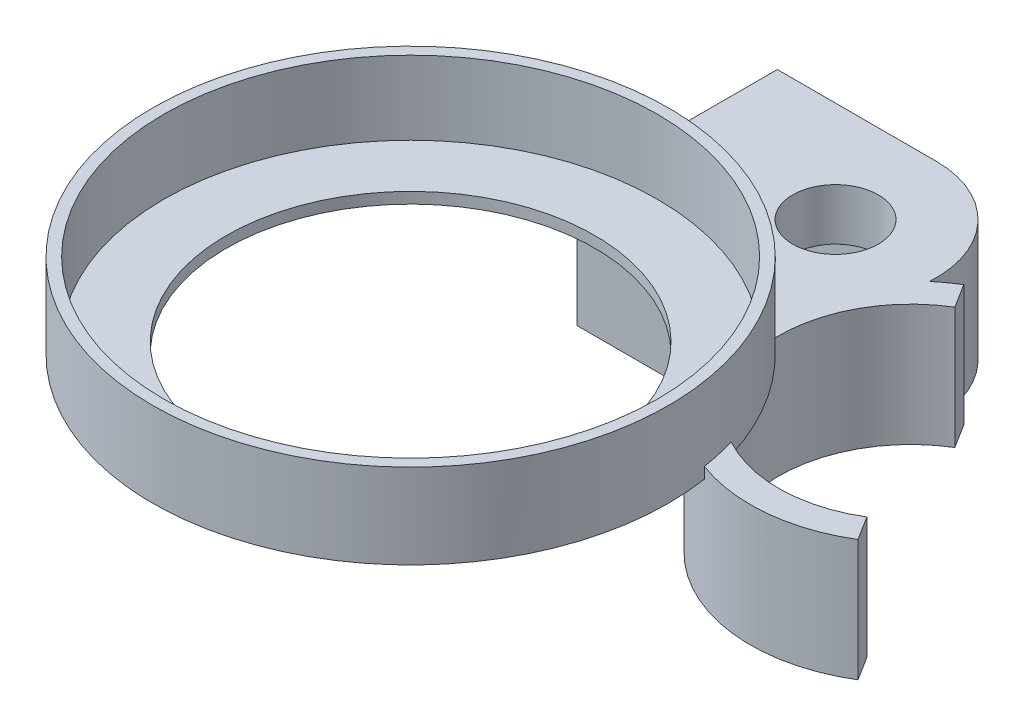
ISO-10303-21;
HEADER;
FILE_DESCRIPTION(('STEP AP214'),'2;1');
FILE_NAME('part.step','',(''),(''),'','','');
FILE_SCHEMA(('AUTOMOTIVE_DESIGN { 1 0 10303 214 1 1 1 1 }'));
ENDSEC;
DATA;
#1=APPLICATION_CONTEXT('core data for automotive mechanical design processes');
#2=APPLICATION_PROTOCOL_DEFINITION('international standard','automotive_design',2000,#1);
#3=PRODUCT_CONTEXT('',#1,'mechanical');
#4=PRODUCT('Part','Part','',(#3));
#5=PRODUCT_RELATED_PRODUCT_CATEGORY('part','',(#4));
#6=PRODUCT_DEFINITION_FORMATION('','',#4);
#7=PRODUCT_DEFINITION_CONTEXT('part definition',#1,'design');
#8=PRODUCT_DEFINITION('design','',#6,#7);
#9=PRODUCT_DEFINITION_SHAPE('','',#8);
#10=(LENGTH_UNIT() NAMED_UNIT(*) SI_UNIT(.MILLI.,.METRE.));
#11=(NAMED_UNIT(*) PLANE_ANGLE_UNIT() SI_UNIT($,.RADIAN.));
#12=(NAMED_UNIT(*) SI_UNIT($,.STERADIAN.) SOLID_ANGLE_UNIT());
#13=UNCERTAINTY_MEASURE_WITH_UNIT(LENGTH_MEASURE(1.E-05),#10,'distance_accuracy_value','');
#14=(GEOMETRIC_REPRESENTATION_CONTEXT(3) GLOBAL_UNCERTAINTY_ASSIGNED_CONTEXT((#13)) GLOBAL_UNIT_ASSIGNED_CONTEXT((#10,
#11,#12)) REPRESENTATION_CONTEXT('',''));
#15=CARTESIAN_POINT('',(0.,0.,0.));
#16=DIRECTION('',(0.,0.,1.));
#17=DIRECTION('',(1.,0.,0.));
#18=AXIS2_PLACEMENT_3D('',#15,#16,#17);
#19=CARTESIAN_POINT('',(28.9409891897683,3.,-86.4099452660348));
#20=DIRECTION('',(0.,-1.,0.));
#21=DIRECTION('',(0.,0.,-1.));
#22=AXIS2_PLACEMENT_3D('',#19,#20,#21);
#23=CYLINDRICAL_SURFACE('',#22,11.6150837606993);
#24=CARTESIAN_POINT('',(28.9409891897683,3.,-86.4099452660348));
#25=DIRECTION('',(0.,1.,0.));
#26=DIRECTION('',(0.,0.,1.));
#27=AXIS2_PLACEMENT_3D('',#24,#25,#26);
#28=CIRCLE('',#27,11.6150837606993);
#29=CARTESIAN_POINT('',(28.9409891897683,3.,-74.7948615053355));
#30=VERTEX_POINT('',#29);
#31=EDGE_CURVE('E272',#30,#30,#28,.T.);
#32=ORIENTED_EDGE('',*,*,#31,.T.);
#33=EDGE_LOOP('',(#32));
#34=FACE_BOUND('',#33,.T.);
#35=CARTESIAN_POINT('',(28.9409891897683,-11.,-86.4099452660348));
#36=DIRECTION('',(0.,-1.,0.));
#37=DIRECTION('',(0.,0.,-1.));
#38=AXIS2_PLACEMENT_3D('',#35,#36,#37);
#39=CIRCLE('',#38,11.6150837606993);
#40=CARTESIAN_POINT('',(28.9409891897683,-11.,-98.0250290267341));
#41=VERTEX_POINT('',#40);
#42=EDGE_CURVE('E43',#41,#41,#39,.T.);
#43=ORIENTED_EDGE('',*,*,#42,.T.);
#44=EDGE_LOOP('',(#43));
#45=FACE_BOUND('',#44,.T.);
#46=ADVANCED_FACE('F39',(#34,#45),#23,.F.);
#47=CARTESIAN_POINT('',(84.4408765950904,0.,-51.3693294214114));
#48=DIRECTION('',(0.,-1.,0.));
#49=DIRECTION('',(0.,0.,-1.));
#50=AXIS2_PLACEMENT_3D('',#47,#48,#49);
#51=PLANE('',#50);
#52=CARTESIAN_POINT('',(84.4408765950904,0.,-51.3693294214114));
#53=DIRECTION('',(0.,1.,0.));
#54=DIRECTION('',(0.,0.,-1.));
#55=AXIS2_PLACEMENT_3D('',#52,#53,#54);
#56=CIRCLE('',#55,35.8910066065132);
#57=CARTESIAN_POINT('',(48.5625583727208,0.,-50.4150565237816));
#58=VERTEX_POINT('',#57);
#59=CARTESIAN_POINT('',(67.0979306352017,0.,-19.9466213799145));
#60=VERTEX_POINT('',#59);
#61=EDGE_CURVE('E11',#58,#60,#56,.T.);
#62=ORIENTED_EDGE('',*,*,#61,.F.);
#63=CARTESIAN_POINT('',(0.,0.,0.));
#64=DIRECTION('',(0.,1.,0.));
#65=DIRECTION('',(0.,0.,1.));
#66=AXIS2_PLACEMENT_3D('',#63,#64,#65);
#67=CIRCLE('',#66,70.);
#68=EDGE_CURVE('E284',#60,#58,#67,.T.);
#69=ORIENTED_EDGE('',*,*,#68,.F.);
#70=EDGE_LOOP('',(#62,#69));
#71=FACE_BOUND('',#70,.T.);
#72=ADVANCED_FACE('F399',(#71),#51,.T.);
#73=CARTESIAN_POINT('',(84.4408765950904,3.,-51.3693294214114));
#74=DIRECTION('',(0.,-1.,0.));
#75=DIRECTION('',(0.,0.,-1.));
#76=AXIS2_PLACEMENT_3D('',#73,#74,#75);
#77=PLANE('',#76);
#78=CARTESIAN_POINT('',(0.,3.,0.));
#79=DIRECTION('',(0.,1.,0.));
#80=DIRECTION('',(0.,0.,1.));
#81=AXIS2_PLACEMENT_3D('',#78,#79,#80);
#82=CIRCLE('',#81,70.);
#83=CARTESIAN_POINT('',(69.1988699787437,3.,-10.5601322749733));
#84=VERTEX_POINT('',#83);
#85=CARTESIAN_POINT('',(67.0979306352017,3.,-19.9466213799145));
#86=VERTEX_POINT('',#85);
#87=EDGE_CURVE('E264',#84,#86,#82,.T.);
#88=ORIENTED_EDGE('',*,*,#87,.F.);
#89=CARTESIAN_POINT('',(84.4408765950904,3.,-51.3693294214114));
#90=DIRECTION('',(0.,1.,0.));
#91=DIRECTION('',(0.,0.,-1.));
#92=AXIS2_PLACEMENT_3D('',#89,#90,#91);
#93=CIRCLE('',#92,43.5627058093228);
#94=CARTESIAN_POINT('',(107.211450058935,3.,-14.2316084149029));
#95=VERTEX_POINT('',#94);
#96=EDGE_CURVE('E288',#84,#95,#93,.T.);
#97=ORIENTED_EDGE('',*,*,#96,.T.);
#98=DIRECTION('',(-0.530315092657825,0.,-0.847800626621214));
#99=VECTOR('',#98,1.);
#100=CARTESIAN_POINT('',(103.142834496151,3.,-20.7359958467623));
#101=LINE('',#100,#99);
#102=CARTESIAN_POINT('',(103.142834496151,3.,-20.7359958467623));
#103=VERTEX_POINT('',#102);
#104=EDGE_CURVE('E292',#95,#103,#101,.T.);
#105=ORIENTED_EDGE('',*,*,#104,.T.);
#106=CARTESIAN_POINT('',(84.4408765950904,3.,-51.3693294214114));
#107=DIRECTION('',(0.,-1.,0.));
#108=DIRECTION('',(0.,0.,-1.));
#109=AXIS2_PLACEMENT_3D('',#106,#107,#108);
#110=CIRCLE('',#109,35.8910066065132);
#111=EDGE_CURVE('E296',#103,#86,#110,.T.);
#112=ORIENTED_EDGE('',*,*,#111,.T.);
#113=EDGE_LOOP('',(#88,#97,#105,#112));
#114=FACE_BOUND('',#113,.T.);
#115=ADVANCED_FACE('F391',(#114),#77,.F.);
#116=CARTESIAN_POINT('',(0.,3.,0.));
#117=DIRECTION('',(0.,1.,0.));
#118=DIRECTION('',(0.,0.,1.));
#119=AXIS2_PLACEMENT_3D('',#116,#117,#118);
#120=CIRCLE('',#119,50.);
#121=CARTESIAN_POINT('',(0.,3.,50.));
#122=VERTEX_POINT('',#121);
#123=EDGE_CURVE('E280',#122,#122,#120,.T.);
#124=ORIENTED_EDGE('',*,*,#123,.F.);
#125=EDGE_LOOP('',(#124));
#126=FACE_BOUND('',#125,.T.);
#127=CARTESIAN_POINT('',(0.,3.,0.));
#128=DIRECTION('',(0.,1.,0.));
#129=DIRECTION('',(0.,0.,1.));
#130=AXIS2_PLACEMENT_3D('',#127,#128,#129);
#131=CIRCLE('',#130,67.);
#132=CARTESIAN_POINT('',(0.,3.,67.));
#133=VERTEX_POINT('',#132);
#134=EDGE_CURVE('E259',#133,#133,#131,.T.);
#135=ORIENTED_EDGE('',*,*,#134,.T.);
#136=EDGE_LOOP('',(#135));
#137=FACE_BOUND('',#136,.T.);
#138=ADVANCED_FACE('F406',(#126,#137),#77,.F.);
#139=CARTESIAN_POINT('',(48.5625583727208,3.,-50.4150565237816));
#140=VERTEX_POINT('',#139);
#141=CARTESIAN_POINT('',(-14.2233794623213,3.,-68.5397364794381));
#142=VERTEX_POINT('',#141);
#143=EDGE_CURVE('E246',#140,#142,#82,.T.);
#144=ORIENTED_EDGE('',*,*,#143,.F.);
#145=CARTESIAN_POINT('',(84.4408765950904,3.,-51.3693294214114));
#146=DIRECTION('',(0.,-1.,0.));
#147=DIRECTION('',(0.,0.,-1.));
#148=AXIS2_PLACEMENT_3D('',#145,#146,#147);
#149=CIRCLE('',#148,35.8910066065132);
#150=CARTESIAN_POINT('',(65.7389186940296,3.,-82.0026629960604));
#151=VERTEX_POINT('',#150);
#152=EDGE_CURVE('E299',#140,#151,#149,.T.);
#153=ORIENTED_EDGE('',*,*,#152,.T.);
#154=DIRECTION('',(-0.530315092657825,0.,-0.847800626621214));
#155=VECTOR('',#154,1.);
#156=CARTESIAN_POINT('',(61.6703031312458,3.,-88.5070504279199));
#157=LINE('',#156,#155);
#158=CARTESIAN_POINT('',(61.6703031312457,3.,-88.5070504279198));
#159=VERTEX_POINT('',#158);
#160=EDGE_CURVE('E302',#151,#159,#157,.T.);
#161=ORIENTED_EDGE('',*,*,#160,.T.);
#162=CARTESIAN_POINT('',(84.4408765950904,3.,-51.3693294214114));
#163=DIRECTION('',(0.,1.,0.));
#164=DIRECTION('',(0.,0.,-1.));
#165=AXIS2_PLACEMENT_3D('',#162,#163,#164);
#166=CIRCLE('',#165,43.5627058093228);
#167=CARTESIAN_POINT('',(56.2504035303774,3.,-84.5808720808136));
#168=VERTEX_POINT('',#167);
#169=EDGE_CURVE('E305',#159,#168,#166,.T.);
#170=ORIENTED_EDGE('',*,*,#169,.T.);
#171=CARTESIAN_POINT('',(28.9409891897683,3.,-86.4099452660348));
#172=DIRECTION('',(0.,1.,0.));
#173=DIRECTION('',(0.,0.,1.));
#174=AXIS2_PLACEMENT_3D('',#171,#172,#173);
#175=CIRCLE('',#174,27.3705977345026);
#176=CARTESIAN_POINT('',(28.9409891897683,3.,-113.780543000537));
#177=VERTEX_POINT('',#176);
#178=EDGE_CURVE('E308',#168,#177,#175,.T.);
#179=ORIENTED_EDGE('',*,*,#178,.T.);
#180=DIRECTION('',(-1.,0.,0.));
#181=VECTOR('',#180,1.);
#182=CARTESIAN_POINT('',(-14.2233794623213,3.,-113.780543000537));
#183=LINE('',#182,#181);
#184=CARTESIAN_POINT('',(-14.2233794623213,3.,-113.780543000537));
#185=VERTEX_POINT('',#184);
#186=EDGE_CURVE('E311',#177,#185,#183,.T.);
#187=ORIENTED_EDGE('',*,*,#186,.T.);
#188=DIRECTION('',(0.,0.,1.));
#189=VECTOR('',#188,1.);
#190=CARTESIAN_POINT('',(-14.2233794623213,3.,-113.780543000537));
#191=LINE('',#190,#189);
#192=EDGE_CURVE('E314',#185,#142,#191,.T.);
#193=ORIENTED_EDGE('',*,*,#192,.T.);
#194=EDGE_LOOP('',(#144,#153,#161,#170,#179,#187,#193));
#195=FACE_BOUND('',#194,.T.);
#196=ORIENTED_EDGE('',*,*,#31,.F.);
#197=EDGE_LOOP('',(#196));
#198=FACE_BOUND('',#197,.T.);
#199=ADVANCED_FACE('F369',(#195,#198),#77,.F.);
#200=DIRECTION('',(0.,0.,-1.));
#201=VECTOR('',#200,1.);
#202=CARTESIAN_POINT('',(-14.2233794623213,0.,-113.780543000537));
#203=LINE('',#202,#201);
#204=CARTESIAN_POINT('',(-14.2233794623213,0.,-59.378044289773));
#205=VERTEX_POINT('',#204);
#206=CARTESIAN_POINT('',(-14.2233794623213,0.,-68.5397364794381));
#207=VERTEX_POINT('',#206);
#208=EDGE_CURVE('E65',#205,#207,#203,.T.);
#209=ORIENTED_EDGE('',*,*,#208,.F.);
#210=DIRECTION('',(-1.,0.,0.));
#211=VECTOR('',#210,1.);
#212=CARTESIAN_POINT('',(-14.2233794623213,0.,-59.378044289773));
#213=LINE('',#212,#211);
#214=CARTESIAN_POINT('',(41.6206731440688,0.,-59.378044289773));
#215=VERTEX_POINT('',#214);
#216=EDGE_CURVE('E247',#215,#205,#213,.T.);
#217=ORIENTED_EDGE('',*,*,#216,.F.);
#218=CARTESIAN_POINT('',(84.4408765950905,0.,-51.3693294214114));
#219=DIRECTION('',(0.,-1.,0.));
#220=DIRECTION('',(0.,0.,1.));
#221=AXIS2_PLACEMENT_3D('',#218,#219,#220);
#222=CIRCLE('',#221,43.5627058093228);
#223=CARTESIAN_POINT('',(69.1988699787437,0.,-10.5601322749734));
#224=VERTEX_POINT('',#223);
#225=EDGE_CURVE('E49',#224,#215,#222,.T.);
#226=ORIENTED_EDGE('',*,*,#225,.F.);
#227=CARTESIAN_POINT('',(0.,0.,0.));
#228=DIRECTION('',(0.,1.,0.));
#229=DIRECTION('',(0.,0.,1.));
#230=AXIS2_PLACEMENT_3D('',#227,#228,#229);
#231=CIRCLE('',#230,70.);
#232=EDGE_CURVE('E293',#207,#224,#231,.T.);
#233=ORIENTED_EDGE('',*,*,#232,.F.);
#234=EDGE_LOOP('',(#209,#217,#226,#233));
#235=FACE_BOUND('',#234,.T.);
#236=CARTESIAN_POINT('',(0.,0.,0.));
#237=DIRECTION('',(0.,1.,0.));
#238=DIRECTION('',(0.,0.,1.));
#239=AXIS2_PLACEMENT_3D('',#236,#237,#238);
#240=CIRCLE('',#239,50.);
#241=CARTESIAN_POINT('',(0.,0.,50.));
#242=VERTEX_POINT('',#241);
#243=EDGE_CURVE('E279',#242,#242,#240,.T.);
#244=ORIENTED_EDGE('',*,*,#243,.T.);
#245=EDGE_LOOP('',(#244));
#246=FACE_BOUND('',#245,.T.);
#247=ADVANCED_FACE('F384',(#235,#246),#51,.T.);
#248=CARTESIAN_POINT('',(84.4408765950904,3.,-51.3693294214114));
#249=DIRECTION('',(0.,-1.,0.));
#250=DIRECTION('',(0.,0.,-1.));
#251=AXIS2_PLACEMENT_3D('',#248,#249,#250);
#252=CYLINDRICAL_SURFACE('',#251,43.5627058093228);
#253=DIRECTION('',(0.,-1.,0.));
#254=VECTOR('',#253,1.);
#255=CARTESIAN_POINT('',(69.1988699787437,3.,-10.5601322749734));
#256=LINE('',#255,#254);
#257=EDGE_CURVE('E317',#84,#224,#256,.T.);
#258=ORIENTED_EDGE('',*,*,#257,.T.);
#259=ORIENTED_EDGE('',*,*,#225,.T.);
#260=DIRECTION('',(0.,1.,0.));
#261=VECTOR('',#260,1.);
#262=CARTESIAN_POINT('',(41.6206731440688,-30.,-59.378044289773));
#263=LINE('',#262,#261);
#264=CARTESIAN_POINT('',(41.6206731440688,-30.,-59.378044289773));
#265=VERTEX_POINT('',#264);
#266=EDGE_CURVE('E255',#265,#215,#263,.T.);
#267=ORIENTED_EDGE('',*,*,#266,.F.);
#268=CARTESIAN_POINT('',(84.4408765950905,-30.,-51.3693294214114));
#269=DIRECTION('',(0.,-1.,0.));
#270=DIRECTION('',(0.,0.,-1.));
#271=AXIS2_PLACEMENT_3D('',#268,#269,#270);
#272=CIRCLE('',#271,43.5627058093228);
#273=CARTESIAN_POINT('',(107.211450058935,-30.,-14.2316084149029));
#274=VERTEX_POINT('',#273);
#275=EDGE_CURVE('E215',#274,#265,#272,.T.);
#276=ORIENTED_EDGE('',*,*,#275,.F.);
#277=DIRECTION('',(0.,-1.,0.));
#278=VECTOR('',#277,1.);
#279=CARTESIAN_POINT('',(107.211450058935,3.,-14.2316084149029));
#280=LINE('',#279,#278);
#281=EDGE_CURVE('E355',#95,#274,#280,.T.);
#282=ORIENTED_EDGE('',*,*,#281,.F.);
#283=ORIENTED_EDGE('',*,*,#96,.F.);
#284=EDGE_LOOP('',(#258,#259,#267,#276,#282,#283));
#285=FACE_BOUND('',#284,.T.);
#286=ADVANCED_FACE('F41',(#285),#252,.T.);
#287=CARTESIAN_POINT('',(103.142834496151,3.,-20.7359958467623));
#288=DIRECTION('',(-0.847800626621214,0.,0.530315092657825));
#289=DIRECTION('',(0.530315092657825,0.,0.847800626621214));
#290=AXIS2_PLACEMENT_3D('',#287,#288,#289);
#291=PLANE('',#290);
#292=ORIENTED_EDGE('',*,*,#281,.T.);
#293=DIRECTION('',(0.530315092657825,0.,0.847800626621213));
#294=VECTOR('',#293,1.);
#295=CARTESIAN_POINT('',(107.211450058935,-30.,-14.2316084149029));
#296=LINE('',#295,#294);
#297=CARTESIAN_POINT('',(103.142834496151,-30.,-20.7359958467623));
#298=VERTEX_POINT('',#297);
#299=EDGE_CURVE('E211',#298,#274,#296,.T.);
#300=ORIENTED_EDGE('',*,*,#299,.F.);
#301=DIRECTION('',(0.,-1.,0.));
#302=VECTOR('',#301,1.);
#303=CARTESIAN_POINT('',(103.142834496151,3.,-20.7359958467623));
#304=LINE('',#303,#302);
#305=EDGE_CURVE('E353',#103,#298,#304,.T.);
#306=ORIENTED_EDGE('',*,*,#305,.F.);
#307=ORIENTED_EDGE('',*,*,#104,.F.);
#308=EDGE_LOOP('',(#292,#300,#306,#307));
#309=FACE_BOUND('',#308,.T.);
#310=ADVANCED_FACE('F416',(#309),#291,.F.);
#311=CARTESIAN_POINT('',(84.4408765950904,3.,-51.3693294214114));
#312=DIRECTION('',(0.,-1.,0.));
#313=DIRECTION('',(0.,0.,-1.));
#314=AXIS2_PLACEMENT_3D('',#311,#312,#313);
#315=CYLINDRICAL_SURFACE('',#314,35.8910066065132);
#316=DIRECTION('',(0.,-1.,0.));
#317=VECTOR('',#316,1.);
#318=CARTESIAN_POINT('',(48.5625583727208,3.,-50.4150565237816));
#319=LINE('',#318,#317);
#320=EDGE_CURVE('E346',#140,#58,#319,.T.);
#321=ORIENTED_EDGE('',*,*,#320,.T.);
#322=ORIENTED_EDGE('',*,*,#61,.T.);
#323=DIRECTION('',(0.,-1.,0.));
#324=VECTOR('',#323,1.);
#325=CARTESIAN_POINT('',(67.0979306352017,3.,-19.9466213799145));
#326=LINE('',#325,#324);
#327=EDGE_CURVE('E350',#86,#60,#326,.T.);
#328=ORIENTED_EDGE('',*,*,#327,.F.);
#329=ORIENTED_EDGE('',*,*,#111,.F.);
#330=ORIENTED_EDGE('',*,*,#305,.T.);
#331=CARTESIAN_POINT('',(84.4408765950904,-30.,-51.3693294214114));
#332=DIRECTION('',(0.,1.,0.));
#333=DIRECTION('',(0.,0.,-1.));
#334=AXIS2_PLACEMENT_3D('',#331,#332,#333);
#335=CIRCLE('',#334,35.8910066065132);
#336=CARTESIAN_POINT('',(65.7389186940296,-30.,-82.0026629960604));
#337=VERTEX_POINT('',#336);
#338=EDGE_CURVE('E207',#337,#298,#335,.T.);
#339=ORIENTED_EDGE('',*,*,#338,.F.);
#340=DIRECTION('',(0.,-1.,0.));
#341=VECTOR('',#340,1.);
#342=CARTESIAN_POINT('',(65.7389186940296,3.,-82.0026629960604));
#343=LINE('',#342,#341);
#344=EDGE_CURVE('E343',#151,#337,#343,.T.);
#345=ORIENTED_EDGE('',*,*,#344,.F.);
#346=ORIENTED_EDGE('',*,*,#152,.F.);
#347=EDGE_LOOP('',(#321,#322,#328,#329,#330,#339,#345,#346));
#348=FACE_BOUND('',#347,.T.);
#349=ADVANCED_FACE('F396',(#348),#315,.F.);
#350=CARTESIAN_POINT('',(61.6703031312458,3.,-88.5070504279199));
#351=DIRECTION('',(-0.847800626621214,0.,0.530315092657825));
#352=DIRECTION('',(0.530315092657825,0.,0.847800626621214));
#353=AXIS2_PLACEMENT_3D('',#350,#351,#352);
#354=PLANE('',#353);
#355=ORIENTED_EDGE('',*,*,#344,.T.);
#356=DIRECTION('',(0.530315092657823,0.,0.847800626621215));
#357=VECTOR('',#356,1.);
#358=CARTESIAN_POINT('',(65.7389186940296,-30.,-82.0026629960604));
#359=LINE('',#358,#357);
#360=CARTESIAN_POINT('',(61.6703031312458,-30.,-88.5070504279199));
#361=VERTEX_POINT('',#360);
#362=EDGE_CURVE('E238',#361,#337,#359,.T.);
#363=ORIENTED_EDGE('',*,*,#362,.F.);
#364=DIRECTION('',(0.,-1.,0.));
#365=VECTOR('',#364,1.);
#366=CARTESIAN_POINT('',(61.6703031312457,3.,-88.5070504279198));
#367=LINE('',#366,#365);
#368=EDGE_CURVE('E340',#159,#361,#367,.T.);
#369=ORIENTED_EDGE('',*,*,#368,.F.);
#370=ORIENTED_EDGE('',*,*,#160,.F.);
#371=EDGE_LOOP('',(#355,#363,#369,#370));
#372=FACE_BOUND('',#371,.T.);
#373=ADVANCED_FACE('F476',(#372),#354,.F.);
#374=CARTESIAN_POINT('',(84.4408765950904,3.,-51.3693294214114));
#375=DIRECTION('',(0.,-1.,0.));
#376=DIRECTION('',(0.,0.,-1.));
#377=AXIS2_PLACEMENT_3D('',#374,#375,#376);
#378=CYLINDRICAL_SURFACE('',#377,43.5627058093228);
#379=ORIENTED_EDGE('',*,*,#368,.T.);
#380=CARTESIAN_POINT('',(84.4408765950905,-30.,-51.3693294214114));
#381=DIRECTION('',(0.,-1.,0.));
#382=DIRECTION('',(0.,0.,1.));
#383=AXIS2_PLACEMENT_3D('',#380,#381,#382);
#384=CIRCLE('',#383,43.5627058093228);
#385=CARTESIAN_POINT('',(56.2504035303774,-30.,-84.5808720808136));
#386=VERTEX_POINT('',#385);
#387=EDGE_CURVE('E234',#386,#361,#384,.T.);
#388=ORIENTED_EDGE('',*,*,#387,.F.);
#389=DIRECTION('',(0.,-1.,0.));
#390=VECTOR('',#389,1.);
#391=CARTESIAN_POINT('',(56.2504035303774,3.,-84.5808720808136));
#392=LINE('',#391,#390);
#393=EDGE_CURVE('E337',#168,#386,#392,.T.);
#394=ORIENTED_EDGE('',*,*,#393,.F.);
#395=ORIENTED_EDGE('',*,*,#169,.F.);
#396=EDGE_LOOP('',(#379,#388,#394,#395));
#397=FACE_BOUND('',#396,.T.);
#398=ADVANCED_FACE('F471',(#397),#378,.T.);
#399=CARTESIAN_POINT('',(28.9409891897683,3.,-86.4099452660348));
#400=DIRECTION('',(0.,-1.,0.));
#401=DIRECTION('',(0.,0.,-1.));
#402=AXIS2_PLACEMENT_3D('',#399,#400,#401);
#403=CYLINDRICAL_SURFACE('',#402,27.3705977345026);
#404=ORIENTED_EDGE('',*,*,#393,.T.);
#405=CARTESIAN_POINT('',(28.9409891897682,-30.,-86.4099452660347));
#406=DIRECTION('',(0.,-1.,0.));
#407=DIRECTION('',(0.,0.,1.));
#408=AXIS2_PLACEMENT_3D('',#405,#406,#407);
#409=CIRCLE('',#408,27.3705977345027);
#410=CARTESIAN_POINT('',(28.9409891897683,-30.,-113.780543000537));
#411=VERTEX_POINT('',#410);
#412=EDGE_CURVE('E230',#411,#386,#409,.T.);
#413=ORIENTED_EDGE('',*,*,#412,.F.);
#414=DIRECTION('',(0.,-1.,0.));
#415=VECTOR('',#414,1.);
#416=CARTESIAN_POINT('',(28.9409891897683,3.,-113.780543000537));
#417=LINE('',#416,#415);
#418=EDGE_CURVE('E334',#177,#411,#417,.T.);
#419=ORIENTED_EDGE('',*,*,#418,.F.);
#420=ORIENTED_EDGE('',*,*,#178,.F.);
#421=EDGE_LOOP('',(#404,#413,#419,#420));
#422=FACE_BOUND('',#421,.T.);
#423=ADVANCED_FACE('F466',(#422),#403,.T.);
#424=CARTESIAN_POINT('',(-14.2233794623213,3.,-113.780543000537));
#425=DIRECTION('',(0.,0.,1.));
#426=DIRECTION('',(1.,0.,0.));
#427=AXIS2_PLACEMENT_3D('',#424,#425,#426);
#428=PLANE('',#427);
#429=ORIENTED_EDGE('',*,*,#418,.T.);
#430=DIRECTION('',(1.,0.,0.));
#431=VECTOR('',#430,1.);
#432=CARTESIAN_POINT('',(28.9409891897683,-30.,-113.780543000537));
#433=LINE('',#432,#431);
#434=CARTESIAN_POINT('',(-14.2233794623213,-30.,-113.780543000537));
#435=VERTEX_POINT('',#434);
#436=EDGE_CURVE('E226',#435,#411,#433,.T.);
#437=ORIENTED_EDGE('',*,*,#436,.F.);
#438=DIRECTION('',(0.,-1.,0.));
#439=VECTOR('',#438,1.);
#440=CARTESIAN_POINT('',(-14.2233794623213,3.,-113.780543000537));
#441=LINE('',#440,#439);
#442=EDGE_CURVE('E330',#185,#435,#441,.T.);
#443=ORIENTED_EDGE('',*,*,#442,.F.);
#444=ORIENTED_EDGE('',*,*,#186,.F.);
#445=EDGE_LOOP('',(#429,#437,#443,#444));
#446=FACE_BOUND('',#445,.T.);
#447=ADVANCED_FACE('F462',(#446),#428,.F.);
#448=CARTESIAN_POINT('',(-14.2233794623213,3.,-113.780543000537));
#449=DIRECTION('',(1.,0.,0.));
#450=DIRECTION('',(0.,0.,-1.));
#451=AXIS2_PLACEMENT_3D('',#448,#449,#450);
#452=PLANE('',#451);
#453=DIRECTION('',(0.,0.,-1.));
#454=VECTOR('',#453,1.);
#455=CARTESIAN_POINT('',(-14.2233794623213,-30.,-113.780543000537));
#456=LINE('',#455,#454);
#457=CARTESIAN_POINT('',(-14.2233794623213,-30.,-104.59773016291));
#458=VERTEX_POINT('',#457);
#459=EDGE_CURVE('E221',#458,#435,#456,.T.);
#460=ORIENTED_EDGE('',*,*,#459,.F.);
#461=DIRECTION('',(0.,-1.,0.));
#462=VECTOR('',#461,1.);
#463=CARTESIAN_POINT('',(-14.2233794623213,-11.,-104.59773016291));
#464=LINE('',#463,#462);
#465=CARTESIAN_POINT('',(-14.2233794623213,-11.,-104.59773016291));
#466=VERTEX_POINT('',#465);
#467=EDGE_CURVE('E202',#466,#458,#464,.T.);
#468=ORIENTED_EDGE('',*,*,#467,.F.);
#469=DIRECTION('',(0.,0.,-1.));
#470=VECTOR('',#469,1.);
#471=CARTESIAN_POINT('',(-14.2233794623213,-11.,-68.2221603691597));
#472=LINE('',#471,#470);
#473=CARTESIAN_POINT('',(-14.2233794623213,-11.,-68.2221603691597));
#474=VERTEX_POINT('',#473);
#475=EDGE_CURVE('E179',#474,#466,#472,.T.);
#476=ORIENTED_EDGE('',*,*,#475,.F.);
#477=DIRECTION('',(0.,-1.,0.));
#478=VECTOR('',#477,1.);
#479=CARTESIAN_POINT('',(-14.2233794623213,-11.,-68.2221603691597));
#480=LINE('',#479,#478);
#481=CARTESIAN_POINT('',(-14.2233794623213,-30.,-68.2221603691597));
#482=VERTEX_POINT('',#481);
#483=EDGE_CURVE('E169',#474,#482,#480,.T.);
#484=ORIENTED_EDGE('',*,*,#483,.T.);
#485=CARTESIAN_POINT('',(-14.2233794623213,-30.,-59.378044289773));
#486=VERTEX_POINT('',#485);
#487=EDGE_CURVE('E222',#486,#482,#456,.T.);
#488=ORIENTED_EDGE('',*,*,#487,.F.);
#489=DIRECTION('',(0.,1.,0.));
#490=VECTOR('',#489,1.);
#491=CARTESIAN_POINT('',(-14.2233794623213,-30.,-59.378044289773));
#492=LINE('',#491,#490);
#493=EDGE_CURVE('E241',#486,#205,#492,.T.);
#494=ORIENTED_EDGE('',*,*,#493,.T.);
#495=ORIENTED_EDGE('',*,*,#208,.T.);
#496=DIRECTION('',(0.,-1.,0.));
#497=VECTOR('',#496,1.);
#498=CARTESIAN_POINT('',(-14.2233794623213,3.,-68.5397364794381));
#499=LINE('',#498,#497);
#500=EDGE_CURVE('E327',#142,#207,#499,.T.);
#501=ORIENTED_EDGE('',*,*,#500,.F.);
#502=ORIENTED_EDGE('',*,*,#192,.F.);
#503=ORIENTED_EDGE('',*,*,#442,.T.);
#504=EDGE_LOOP('',(#460,#468,#476,#484,#488,#494,#495,#501,#502,#503));
#505=FACE_BOUND('',#504,.T.);
#506=ADVANCED_FACE('F377',(#505),#452,.F.);
#507=CARTESIAN_POINT('',(0.,3.,0.));
#508=DIRECTION('',(0.,-1.,0.));
#509=DIRECTION('',(0.,0.,-1.));
#510=AXIS2_PLACEMENT_3D('',#507,#508,#509);
#511=CYLINDRICAL_SURFACE('',#510,70.);
#512=ORIENTED_EDGE('',*,*,#232,.T.);
#513=ORIENTED_EDGE('',*,*,#257,.F.);
#514=ORIENTED_EDGE('',*,*,#87,.T.);
#515=ORIENTED_EDGE('',*,*,#327,.T.);
#516=ORIENTED_EDGE('',*,*,#68,.T.);
#517=ORIENTED_EDGE('',*,*,#320,.F.);
#518=ORIENTED_EDGE('',*,*,#143,.T.);
#519=ORIENTED_EDGE('',*,*,#500,.T.);
#520=EDGE_LOOP('',(#512,#513,#514,#515,#516,#517,#518,#519));
#521=FACE_BOUND('',#520,.T.);
#522=CARTESIAN_POINT('',(0.,23.,0.));
#523=DIRECTION('',(0.,1.,0.));
#524=DIRECTION('',(0.,0.,1.));
#525=AXIS2_PLACEMENT_3D('',#522,#523,#524);
#526=CIRCLE('',#525,70.);
#527=CARTESIAN_POINT('',(0.,23.,70.));
#528=VERTEX_POINT('',#527);
#529=EDGE_CURVE('E268',#528,#528,#526,.T.);
#530=ORIENTED_EDGE('',*,*,#529,.F.);
#531=EDGE_LOOP('',(#530));
#532=FACE_BOUND('',#531,.T.);
#533=ADVANCED_FACE('F364',(#521,#532),#511,.T.);
#534=CARTESIAN_POINT('',(0.,3.,0.));
#535=DIRECTION('',(0.,-1.,0.));
#536=DIRECTION('',(0.,0.,-1.));
#537=AXIS2_PLACEMENT_3D('',#534,#535,#536);
#538=CYLINDRICAL_SURFACE('',#537,50.);
#539=ORIENTED_EDGE('',*,*,#123,.T.);
#540=EDGE_LOOP('',(#539));
#541=FACE_BOUND('',#540,.T.);
#542=ORIENTED_EDGE('',*,*,#243,.F.);
#543=EDGE_LOOP('',(#542));
#544=FACE_BOUND('',#543,.T.);
#545=ADVANCED_FACE('F422',(#541,#544),#538,.F.);
#546=CARTESIAN_POINT('',(0.,23.,0.));
#547=DIRECTION('',(0.,1.,0.));
#548=DIRECTION('',(0.,0.,1.));
#549=AXIS2_PLACEMENT_3D('',#546,#547,#548);
#550=PLANE('',#549);
#551=ORIENTED_EDGE('',*,*,#529,.T.);
#552=EDGE_LOOP('',(#551));
#553=FACE_BOUND('',#552,.T.);
#554=CARTESIAN_POINT('',(0.,23.,0.));
#555=DIRECTION('',(0.,1.,0.));
#556=DIRECTION('',(0.,0.,1.));
#557=AXIS2_PLACEMENT_3D('',#554,#555,#556);
#558=CIRCLE('',#557,67.);
#559=CARTESIAN_POINT('',(0.,23.,67.));
#560=VERTEX_POINT('',#559);
#561=EDGE_CURVE('E260',#560,#560,#558,.T.);
#562=ORIENTED_EDGE('',*,*,#561,.F.);
#563=EDGE_LOOP('',(#562));
#564=FACE_BOUND('',#563,.T.);
#565=ADVANCED_FACE('F424',(#553,#564),#550,.T.);
#566=CARTESIAN_POINT('',(0.,23.,0.));
#567=DIRECTION('',(0.,-1.,0.));
#568=DIRECTION('',(0.,0.,-1.));
#569=AXIS2_PLACEMENT_3D('',#566,#567,#568);
#570=CYLINDRICAL_SURFACE('',#569,67.);
#571=ORIENTED_EDGE('',*,*,#561,.T.);
#572=EDGE_LOOP('',(#571));
#573=FACE_BOUND('',#572,.T.);
#574=ORIENTED_EDGE('',*,*,#134,.F.);
#575=EDGE_LOOP('',(#574));
#576=FACE_BOUND('',#575,.T.);
#577=ADVANCED_FACE('F429',(#573,#576),#570,.F.);
#578=CARTESIAN_POINT('',(84.4408765950904,-30.,-51.3693294214114));
#579=DIRECTION('',(0.,-1.,0.));
#580=DIRECTION('',(0.,0.,-1.));
#581=AXIS2_PLACEMENT_3D('',#578,#579,#580);
#582=PLANE('',#581);
#583=DIRECTION('',(1.,0.,0.));
#584=VECTOR('',#583,1.);
#585=CARTESIAN_POINT('',(28.9409891897683,-30.,-104.59773016291));
#586=LINE('',#585,#584);
#587=CARTESIAN_POINT('',(28.9409891897683,-30.,-104.59773016291));
#588=VERTEX_POINT('',#587);
#589=EDGE_CURVE('E184',#458,#588,#586,.T.);
#590=ORIENTED_EDGE('',*,*,#589,.F.);
#591=ORIENTED_EDGE('',*,*,#459,.T.);
#592=ORIENTED_EDGE('',*,*,#436,.T.);
#593=ORIENTED_EDGE('',*,*,#412,.T.);
#594=ORIENTED_EDGE('',*,*,#387,.T.);
#595=ORIENTED_EDGE('',*,*,#362,.T.);
#596=ORIENTED_EDGE('',*,*,#338,.T.);
#597=ORIENTED_EDGE('',*,*,#299,.T.);
#598=ORIENTED_EDGE('',*,*,#275,.T.);
#599=DIRECTION('',(-1.,0.,0.));
#600=VECTOR('',#599,1.);
#601=CARTESIAN_POINT('',(-14.2233794623213,-30.,-59.378044289773));
#602=LINE('',#601,#600);
#603=EDGE_CURVE('E218',#265,#486,#602,.T.);
#604=ORIENTED_EDGE('',*,*,#603,.T.);
#605=ORIENTED_EDGE('',*,*,#487,.T.);
#606=DIRECTION('',(-1.,0.,0.));
#607=VECTOR('',#606,1.);
#608=CARTESIAN_POINT('',(28.9409891897683,-30.,-68.2221603691597));
#609=LINE('',#608,#607);
#610=CARTESIAN_POINT('',(28.9409891897683,-30.,-68.2221603691597));
#611=VERTEX_POINT('',#610);
#612=EDGE_CURVE('E188',#611,#482,#609,.T.);
#613=ORIENTED_EDGE('',*,*,#612,.F.);
#614=CARTESIAN_POINT('',(28.9409891897683,-30.,-86.4099452660348));
#615=DIRECTION('',(0.,-1.,0.));
#616=DIRECTION('',(0.,0.,-1.));
#617=AXIS2_PLACEMENT_3D('',#614,#615,#616);
#618=CIRCLE('',#617,18.1877848968751);
#619=EDGE_CURVE('E57',#588,#611,#618,.T.);
#620=ORIENTED_EDGE('',*,*,#619,.F.);
#621=EDGE_LOOP('',(#590,#591,#592,#593,#594,#595,#596,#597,#598,#604,#605,#613,#620));
#622=FACE_BOUND('',#621,.T.);
#623=ADVANCED_FACE('F433',(#622),#582,.T.);
#624=CARTESIAN_POINT('',(-14.2233794623213,-30.,-59.378044289773));
#625=DIRECTION('',(0.,0.,-1.));
#626=DIRECTION('',(-1.,0.,0.));
#627=AXIS2_PLACEMENT_3D('',#624,#625,#626);
#628=PLANE('',#627);
#629=ORIENTED_EDGE('',*,*,#216,.T.);
#630=ORIENTED_EDGE('',*,*,#493,.F.);
#631=ORIENTED_EDGE('',*,*,#603,.F.);
#632=ORIENTED_EDGE('',*,*,#266,.T.);
#633=EDGE_LOOP('',(#629,#630,#631,#632));
#634=FACE_BOUND('',#633,.T.);
#635=ADVANCED_FACE('F382',(#634),#628,.F.);
#636=CARTESIAN_POINT('',(28.9409891897683,-11.,-86.4099452660348));
#637=DIRECTION('',(0.,-1.,0.));
#638=DIRECTION('',(0.,0.,-1.));
#639=AXIS2_PLACEMENT_3D('',#636,#637,#638);
#640=CYLINDRICAL_SURFACE('',#639,18.1877848968751);
#641=ORIENTED_EDGE('',*,*,#619,.T.);
#642=DIRECTION('',(0.,-1.,0.));
#643=VECTOR('',#642,1.);
#644=CARTESIAN_POINT('',(28.9409891897683,-11.,-68.2221603691597));
#645=LINE('',#644,#643);
#646=CARTESIAN_POINT('',(28.9409891897683,-11.,-68.2221603691597));
#647=VERTEX_POINT('',#646);
#648=EDGE_CURVE('E160',#647,#611,#645,.T.);
#649=ORIENTED_EDGE('',*,*,#648,.F.);
#650=CARTESIAN_POINT('',(28.9409891897683,-11.,-86.4099452660348));
#651=DIRECTION('',(0.,-1.,0.));
#652=DIRECTION('',(0.,0.,-1.));
#653=AXIS2_PLACEMENT_3D('',#650,#651,#652);
#654=CIRCLE('',#653,18.1877848968751);
#655=CARTESIAN_POINT('',(28.9409891897683,-11.,-104.59773016291));
#656=VERTEX_POINT('',#655);
#657=EDGE_CURVE('E164',#656,#647,#654,.T.);
#658=ORIENTED_EDGE('',*,*,#657,.F.);
#659=DIRECTION('',(0.,-1.,0.));
#660=VECTOR('',#659,1.);
#661=CARTESIAN_POINT('',(28.9409891897683,-11.,-104.59773016291));
#662=LINE('',#661,#660);
#663=EDGE_CURVE('E199',#656,#588,#662,.T.);
#664=ORIENTED_EDGE('',*,*,#663,.T.);
#665=EDGE_LOOP('',(#641,#649,#658,#664));
#666=FACE_BOUND('',#665,.T.);
#667=ADVANCED_FACE('F162',(#666),#640,.F.);
#668=CARTESIAN_POINT('',(28.9409891897683,-11.,-104.59773016291));
#669=DIRECTION('',(0.,0.,-1.));
#670=DIRECTION('',(-1.,0.,0.));
#671=AXIS2_PLACEMENT_3D('',#668,#669,#670);
#672=PLANE('',#671);
#673=ORIENTED_EDGE('',*,*,#589,.T.);
#674=ORIENTED_EDGE('',*,*,#663,.F.);
#675=DIRECTION('',(1.,0.,0.));
#676=VECTOR('',#675,1.);
#677=CARTESIAN_POINT('',(28.9409891897683,-11.,-104.59773016291));
#678=LINE('',#677,#676);
#679=EDGE_CURVE('E170',#466,#656,#678,.T.);
#680=ORIENTED_EDGE('',*,*,#679,.F.);
#681=ORIENTED_EDGE('',*,*,#467,.T.);
#682=EDGE_LOOP('',(#673,#674,#680,#681));
#683=FACE_BOUND('',#682,.T.);
#684=ADVANCED_FACE('F442',(#683),#672,.F.);
#685=CARTESIAN_POINT('',(28.9409891897683,-11.,-68.2221603691597));
#686=DIRECTION('',(0.,0.,1.));
#687=DIRECTION('',(1.,0.,0.));
#688=AXIS2_PLACEMENT_3D('',#685,#686,#687);
#689=PLANE('',#688);
#690=ORIENTED_EDGE('',*,*,#612,.T.);
#691=ORIENTED_EDGE('',*,*,#483,.F.);
#692=DIRECTION('',(-1.,0.,0.));
#693=VECTOR('',#692,1.);
#694=CARTESIAN_POINT('',(28.9409891897683,-11.,-68.2221603691597));
#695=LINE('',#694,#693);
#696=EDGE_CURVE('E173',#647,#474,#695,.T.);
#697=ORIENTED_EDGE('',*,*,#696,.F.);
#698=ORIENTED_EDGE('',*,*,#648,.T.);
#699=EDGE_LOOP('',(#690,#691,#697,#698));
#700=FACE_BOUND('',#699,.T.);
#701=ADVANCED_FACE('F174',(#700),#689,.F.);
#702=CARTESIAN_POINT('',(28.9409891897683,-11.,-86.4099452660348));
#703=DIRECTION('',(0.,-1.,0.));
#704=DIRECTION('',(0.,0.,-1.));
#705=AXIS2_PLACEMENT_3D('',#702,#703,#704);
#706=PLANE('',#705);
#707=ORIENTED_EDGE('',*,*,#42,.F.);
#708=EDGE_LOOP('',(#707));
#709=FACE_BOUND('',#708,.T.);
#710=ORIENTED_EDGE('',*,*,#657,.T.);
#711=ORIENTED_EDGE('',*,*,#696,.T.);
#712=ORIENTED_EDGE('',*,*,#475,.T.);
#713=ORIENTED_EDGE('',*,*,#679,.T.);
#714=EDGE_LOOP('',(#710,#711,#712,#713));
#715=FACE_BOUND('',#714,.T.);
#716=ADVANCED_FACE('F181',(#709,#715),#706,.T.);
#717=CLOSED_SHELL('',(#46,#72,#115,#138,#199,#247,#286,#310,#349,#373,#398,#423,#447,#506,#533,
#545,#565,#577,#623,#635,#667,#684,#701,#716));
#718=MANIFOLD_SOLID_BREP('B2',#717);
#719=ADVANCED_BREP_SHAPE_REPRESENTATION('',(#18,#718),#14);
#720=SHAPE_DEFINITION_REPRESENTATION(#9,#719);
ENDSEC;
END-ISO-10303-21;
